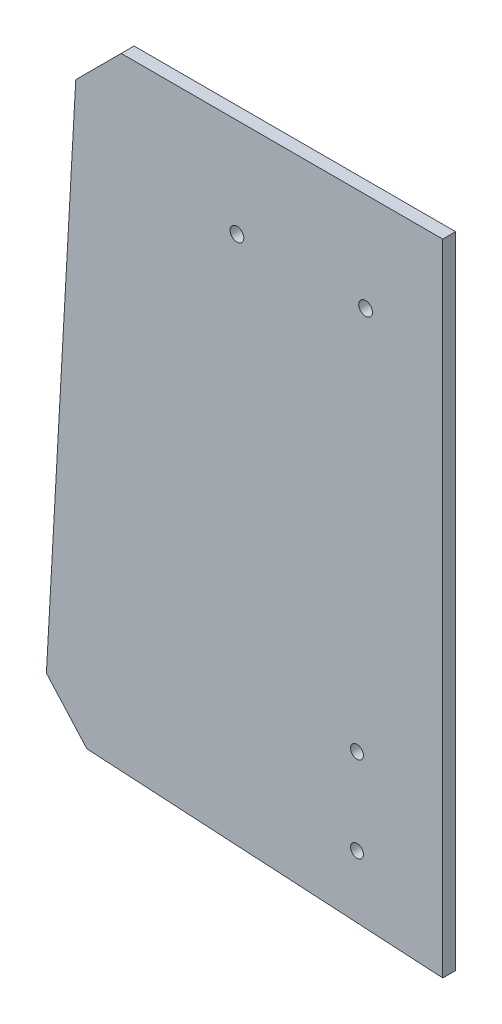
ISO-10303-21;
HEADER;
FILE_DESCRIPTION(('STEP AP214'),'2;1');
FILE_NAME('part.step','',(''),(''),'','','');
FILE_SCHEMA(('AUTOMOTIVE_DESIGN { 1 0 10303 214 1 1 1 1 }'));
ENDSEC;
DATA;
#1=APPLICATION_CONTEXT('core data for automotive mechanical design processes');
#2=APPLICATION_PROTOCOL_DEFINITION('international standard','automotive_design',2000,#1);
#3=PRODUCT_CONTEXT('',#1,'mechanical');
#4=PRODUCT('Part','Part','',(#3));
#5=PRODUCT_RELATED_PRODUCT_CATEGORY('part','',(#4));
#6=PRODUCT_DEFINITION_FORMATION('','',#4);
#7=PRODUCT_DEFINITION_CONTEXT('part definition',#1,'design');
#8=PRODUCT_DEFINITION('design','',#6,#7);
#9=PRODUCT_DEFINITION_SHAPE('','',#8);
#10=(LENGTH_UNIT() NAMED_UNIT(*) SI_UNIT(.MILLI.,.METRE.));
#11=(NAMED_UNIT(*) PLANE_ANGLE_UNIT() SI_UNIT($,.RADIAN.));
#12=(NAMED_UNIT(*) SI_UNIT($,.STERADIAN.) SOLID_ANGLE_UNIT());
#13=UNCERTAINTY_MEASURE_WITH_UNIT(LENGTH_MEASURE(1.E-05),#10,'distance_accuracy_value','');
#14=(GEOMETRIC_REPRESENTATION_CONTEXT(3) GLOBAL_UNCERTAINTY_ASSIGNED_CONTEXT((#13)) GLOBAL_UNIT_ASSIGNED_CONTEXT((#10,
#11,#12)) REPRESENTATION_CONTEXT('',''));
#15=CARTESIAN_POINT('',(0.,0.,0.));
#16=DIRECTION('',(0.,0.,1.));
#17=DIRECTION('',(1.,0.,0.));
#18=AXIS2_PLACEMENT_3D('',#15,#16,#17);
#19=CARTESIAN_POINT('',(0.,33.3553390593262,3.));
#20=DIRECTION('',(0.,1.,0.));
#21=DIRECTION('',(0.,0.,1.));
#22=AXIS2_PLACEMENT_3D('',#19,#20,#21);
#23=PLANE('',#22);
#24=DIRECTION('',(1.,0.,0.));
#25=VECTOR('',#24,1.);
#26=CARTESIAN_POINT('',(0.,33.3553390593262,0.));
#27=LINE('',#26,#25);
#28=CARTESIAN_POINT('',(-71.9999999999999,33.3553390593262,0.));
#29=VERTEX_POINT('',#28);
#30=CARTESIAN_POINT('',(3.00000000000009,33.3553390593262,0.));
#31=VERTEX_POINT('',#30);
#32=EDGE_CURVE('E129',#29,#31,#27,.T.);
#33=ORIENTED_EDGE('',*,*,#32,.F.);
#34=DIRECTION('',(0.,0.,1.));
#35=VECTOR('',#34,1.);
#36=CARTESIAN_POINT('',(-71.9999999999999,33.3553390593262,3.));
#37=LINE('',#36,#35);
#38=CARTESIAN_POINT('',(-71.9999999999999,33.3553390593262,3.));
#39=VERTEX_POINT('',#38);
#40=EDGE_CURVE('E60',#29,#39,#37,.T.);
#41=ORIENTED_EDGE('',*,*,#40,.T.);
#42=DIRECTION('',(1.,0.,0.));
#43=VECTOR('',#42,1.);
#44=CARTESIAN_POINT('',(0.,33.3553390593262,3.));
#45=LINE('',#44,#43);
#46=CARTESIAN_POINT('',(3.00000000000009,33.3553390593262,3.));
#47=VERTEX_POINT('',#46);
#48=EDGE_CURVE('E149',#39,#47,#45,.T.);
#49=ORIENTED_EDGE('',*,*,#48,.T.);
#50=DIRECTION('',(0.,0.,-1.));
#51=VECTOR('',#50,1.);
#52=CARTESIAN_POINT('',(3.00000000000009,33.3553390593262,3.));
#53=LINE('',#52,#51);
#54=EDGE_CURVE('E103',#47,#31,#53,.T.);
#55=ORIENTED_EDGE('',*,*,#54,.T.);
#56=EDGE_LOOP('',(#33,#41,#49,#55));
#57=FACE_BOUND('',#56,.T.);
#58=ADVANCED_FACE('F37',(#57),#23,.T.);
#59=CARTESIAN_POINT('',(-83.596110863182,4.64787317759823,3.));
#60=DIRECTION('',(-0.998457941212826,0.0555134184593621,0.));
#61=DIRECTION('',(-0.0555134184593621,-0.998457941212826,0.));
#62=AXIS2_PLACEMENT_3D('',#59,#60,#61);
#63=PLANE('',#62);
#64=DIRECTION('',(0.0555134184593621,0.998457941212826,0.));
#65=VECTOR('',#64,1.);
#66=CARTESIAN_POINT('',(-83.596110863182,4.64787317759823,3.));
#67=LINE('',#66,#65);
#68=CARTESIAN_POINT('',(-89.4448658154063,-100.547158768256,3.));
#69=VERTEX_POINT('',#68);
#70=CARTESIAN_POINT('',(-82.5887241202404,22.7666149390858,3.));
#71=VERTEX_POINT('',#70);
#72=EDGE_CURVE('E108',#69,#71,#67,.T.);
#73=ORIENTED_EDGE('',*,*,#72,.T.);
#74=DIRECTION('',(0.,0.,-1.));
#75=VECTOR('',#74,1.);
#76=CARTESIAN_POINT('',(-82.5887241202404,22.7666149390858,3.));
#77=LINE('',#76,#75);
#78=CARTESIAN_POINT('',(-82.5887241202404,22.7666149390858,0.));
#79=VERTEX_POINT('',#78);
#80=EDGE_CURVE('E139',#71,#79,#77,.T.);
#81=ORIENTED_EDGE('',*,*,#80,.T.);
#82=DIRECTION('',(0.0555134184593621,0.998457941212826,0.));
#83=VECTOR('',#82,1.);
#84=CARTESIAN_POINT('',(-83.596110863182,4.64787317759823,0.));
#85=LINE('',#84,#83);
#86=CARTESIAN_POINT('',(-89.4448658154063,-100.547158768256,0.));
#87=VERTEX_POINT('',#86);
#88=EDGE_CURVE('E131',#87,#79,#85,.T.);
#89=ORIENTED_EDGE('',*,*,#88,.F.);
#90=DIRECTION('',(0.,0.,1.));
#91=VECTOR('',#90,1.);
#92=CARTESIAN_POINT('',(-89.4448658154063,-100.547158768256,3.));
#93=LINE('',#92,#91);
#94=EDGE_CURVE('E102',#87,#69,#93,.T.);
#95=ORIENTED_EDGE('',*,*,#94,.T.);
#96=EDGE_LOOP('',(#73,#81,#89,#95));
#97=FACE_BOUND('',#96,.T.);
#98=ADVANCED_FACE('F153',(#97),#63,.T.);
#99=CARTESIAN_POINT('',(-6.65290391871126,-115.339295065632,3.));
#100=DIRECTION('',(-0.0575854392452596,-0.998340581759016,0.));
#101=DIRECTION('',(0.998340581759016,-0.0575854392452596,0.));
#102=AXIS2_PLACEMENT_3D('',#99,#100,#101);
#103=PLANE('',#102);
#104=DIRECTION('',(-0.998340581759016,0.0575854392452596,0.));
#105=VECTOR('',#104,1.);
#106=CARTESIAN_POINT('',(-6.65290391871126,-115.339295065632,3.));
#107=LINE('',#106,#105);
#108=CARTESIAN_POINT('',(3.00000000000012,-115.896085726362,3.));
#109=VERTEX_POINT('',#108);
#110=CARTESIAN_POINT('',(-79.9958105372835,-111.108791397522,3.));
#111=VERTEX_POINT('',#110);
#112=EDGE_CURVE('E94',#109,#111,#107,.T.);
#113=ORIENTED_EDGE('',*,*,#112,.T.);
#114=DIRECTION('',(0.,0.,-1.));
#115=VECTOR('',#114,1.);
#116=CARTESIAN_POINT('',(-79.9958105372835,-111.108791397522,3.));
#117=LINE('',#116,#115);
#118=CARTESIAN_POINT('',(-79.9958105372835,-111.108791397522,0.));
#119=VERTEX_POINT('',#118);
#120=EDGE_CURVE('E11',#111,#119,#117,.T.);
#121=ORIENTED_EDGE('',*,*,#120,.T.);
#122=DIRECTION('',(-0.998340581759016,0.0575854392452596,0.));
#123=VECTOR('',#122,1.);
#124=CARTESIAN_POINT('',(-6.65290391871126,-115.339295065632,0.));
#125=LINE('',#124,#123);
#126=CARTESIAN_POINT('',(3.00000000000012,-115.896085726362,0.));
#127=VERTEX_POINT('',#126);
#128=EDGE_CURVE('E97',#127,#119,#125,.T.);
#129=ORIENTED_EDGE('',*,*,#128,.F.);
#130=DIRECTION('',(0.,0.,-1.));
#131=VECTOR('',#130,1.);
#132=CARTESIAN_POINT('',(3.00000000000012,-115.896085726362,3.));
#133=LINE('',#132,#131);
#134=EDGE_CURVE('E92',#109,#127,#133,.T.);
#135=ORIENTED_EDGE('',*,*,#134,.F.);
#136=EDGE_LOOP('',(#113,#121,#129,#135));
#137=FACE_BOUND('',#136,.T.);
#138=ADVANCED_FACE('F93',(#137),#103,.T.);
#139=CARTESIAN_POINT('',(-17.0000000000009,-100.20815280171,3.));
#140=DIRECTION('',(0.,0.,-1.));
#141=DIRECTION('',(-1.,0.,0.));
#142=AXIS2_PLACEMENT_3D('',#139,#140,#141);
#143=CYLINDRICAL_SURFACE('',#142,1.5);
#144=CARTESIAN_POINT('',(-17.0000000000009,-100.20815280171,3.));
#145=DIRECTION('',(0.,0.,1.));
#146=DIRECTION('',(1.,0.,0.));
#147=AXIS2_PLACEMENT_3D('',#144,#145,#146);
#148=CIRCLE('',#147,1.5);
#149=CARTESIAN_POINT('',(-15.5000000000009,-100.20815280171,3.));
#150=VERTEX_POINT('',#149);
#151=EDGE_CURVE('E291',#150,#150,#148,.T.);
#152=ORIENTED_EDGE('',*,*,#151,.T.);
#153=EDGE_LOOP('',(#152));
#154=FACE_BOUND('',#153,.T.);
#155=CARTESIAN_POINT('',(-17.0000000000009,-100.20815280171,0.));
#156=DIRECTION('',(0.,0.,1.));
#157=DIRECTION('',(1.,0.,0.));
#158=AXIS2_PLACEMENT_3D('',#155,#156,#157);
#159=CIRCLE('',#158,1.5);
#160=CARTESIAN_POINT('',(-15.5000000000009,-100.20815280171,0.));
#161=VERTEX_POINT('',#160);
#162=EDGE_CURVE('E126',#161,#161,#159,.T.);
#163=ORIENTED_EDGE('',*,*,#162,.F.);
#164=EDGE_LOOP('',(#163));
#165=FACE_BOUND('',#164,.T.);
#166=ADVANCED_FACE('F172',(#154,#165),#143,.F.);
#167=CARTESIAN_POINT('',(-17.0000000000009,-80.2081528017101,3.));
#168=DIRECTION('',(0.,0.,-1.));
#169=DIRECTION('',(-1.,0.,0.));
#170=AXIS2_PLACEMENT_3D('',#167,#168,#169);
#171=CYLINDRICAL_SURFACE('',#170,1.5);
#172=CARTESIAN_POINT('',(-17.0000000000009,-80.2081528017101,3.));
#173=DIRECTION('',(0.,0.,1.));
#174=DIRECTION('',(1.,0.,0.));
#175=AXIS2_PLACEMENT_3D('',#172,#173,#174);
#176=CIRCLE('',#175,1.5);
#177=CARTESIAN_POINT('',(-15.5000000000009,-80.2081528017101,3.));
#178=VERTEX_POINT('',#177);
#179=EDGE_CURVE('E288',#178,#178,#176,.T.);
#180=ORIENTED_EDGE('',*,*,#179,.T.);
#181=EDGE_LOOP('',(#180));
#182=FACE_BOUND('',#181,.T.);
#183=CARTESIAN_POINT('',(-17.0000000000009,-80.2081528017101,0.));
#184=DIRECTION('',(0.,0.,1.));
#185=DIRECTION('',(1.,0.,0.));
#186=AXIS2_PLACEMENT_3D('',#183,#184,#185);
#187=CIRCLE('',#186,1.5);
#188=CARTESIAN_POINT('',(-15.5000000000009,-80.2081528017101,0.));
#189=VERTEX_POINT('',#188);
#190=EDGE_CURVE('E123',#189,#189,#187,.T.);
#191=ORIENTED_EDGE('',*,*,#190,.F.);
#192=EDGE_LOOP('',(#191));
#193=FACE_BOUND('',#192,.T.);
#194=ADVANCED_FACE('F175',(#182,#193),#171,.F.);
#195=CARTESIAN_POINT('',(-14.9999999999999,10.3553390593263,3.));
#196=DIRECTION('',(0.,0.,-1.));
#197=DIRECTION('',(-1.,0.,0.));
#198=AXIS2_PLACEMENT_3D('',#195,#196,#197);
#199=CYLINDRICAL_SURFACE('',#198,1.60000000000002);
#200=CARTESIAN_POINT('',(-14.9999999999999,10.3553390593263,3.));
#201=DIRECTION('',(0.,0.,1.));
#202=DIRECTION('',(1.,0.,0.));
#203=AXIS2_PLACEMENT_3D('',#200,#201,#202);
#204=CIRCLE('',#203,1.60000000000002);
#205=CARTESIAN_POINT('',(-13.3999999999998,10.3553390593263,3.));
#206=VERTEX_POINT('',#205);
#207=EDGE_CURVE('E284',#206,#206,#204,.T.);
#208=ORIENTED_EDGE('',*,*,#207,.T.);
#209=EDGE_LOOP('',(#208));
#210=FACE_BOUND('',#209,.T.);
#211=CARTESIAN_POINT('',(-14.9999999999999,10.3553390593263,0.));
#212=DIRECTION('',(0.,0.,1.));
#213=DIRECTION('',(1.,0.,0.));
#214=AXIS2_PLACEMENT_3D('',#211,#212,#213);
#215=CIRCLE('',#214,1.60000000000002);
#216=CARTESIAN_POINT('',(-13.3999999999998,10.3553390593263,0.));
#217=VERTEX_POINT('',#216);
#218=EDGE_CURVE('E120',#217,#217,#215,.T.);
#219=ORIENTED_EDGE('',*,*,#218,.F.);
#220=EDGE_LOOP('',(#219));
#221=FACE_BOUND('',#220,.T.);
#222=ADVANCED_FACE('F179',(#210,#221),#199,.F.);
#223=CARTESIAN_POINT('',(-44.9999999999999,10.3553390593262,3.));
#224=DIRECTION('',(0.,0.,-1.));
#225=DIRECTION('',(-1.,0.,0.));
#226=AXIS2_PLACEMENT_3D('',#223,#224,#225);
#227=CYLINDRICAL_SURFACE('',#226,1.60000000000002);
#228=CARTESIAN_POINT('',(-44.9999999999999,10.3553390593262,3.));
#229=DIRECTION('',(0.,0.,1.));
#230=DIRECTION('',(1.,0.,0.));
#231=AXIS2_PLACEMENT_3D('',#228,#229,#230);
#232=CIRCLE('',#231,1.60000000000002);
#233=CARTESIAN_POINT('',(-43.3999999999998,10.3553390593262,3.));
#234=VERTEX_POINT('',#233);
#235=EDGE_CURVE('E136',#234,#234,#232,.T.);
#236=ORIENTED_EDGE('',*,*,#235,.T.);
#237=EDGE_LOOP('',(#236));
#238=FACE_BOUND('',#237,.T.);
#239=CARTESIAN_POINT('',(-44.9999999999999,10.3553390593262,0.));
#240=DIRECTION('',(0.,0.,1.));
#241=DIRECTION('',(1.,0.,0.));
#242=AXIS2_PLACEMENT_3D('',#239,#240,#241);
#243=CIRCLE('',#242,1.60000000000002);
#244=CARTESIAN_POINT('',(-43.3999999999998,10.3553390593262,0.));
#245=VERTEX_POINT('',#244);
#246=EDGE_CURVE('E117',#245,#245,#243,.T.);
#247=ORIENTED_EDGE('',*,*,#246,.F.);
#248=EDGE_LOOP('',(#247));
#249=FACE_BOUND('',#248,.T.);
#250=ADVANCED_FACE('F183',(#238,#249),#227,.F.);
#251=CARTESIAN_POINT('',(3.0000000000001,0.,3.));
#252=DIRECTION('',(1.,0.,0.));
#253=DIRECTION('',(0.,1.,0.));
#254=AXIS2_PLACEMENT_3D('',#251,#252,#253);
#255=PLANE('',#254);
#256=DIRECTION('',(0.,-1.,0.));
#257=VECTOR('',#256,1.);
#258=CARTESIAN_POINT('',(3.0000000000001,0.,0.));
#259=LINE('',#258,#257);
#260=EDGE_CURVE('E135',#31,#127,#259,.T.);
#261=ORIENTED_EDGE('',*,*,#260,.F.);
#262=ORIENTED_EDGE('',*,*,#54,.F.);
#263=DIRECTION('',(0.,-1.,0.));
#264=VECTOR('',#263,1.);
#265=CARTESIAN_POINT('',(3.0000000000001,0.,3.));
#266=LINE('',#265,#264);
#267=EDGE_CURVE('E107',#47,#109,#266,.T.);
#268=ORIENTED_EDGE('',*,*,#267,.T.);
#269=ORIENTED_EDGE('',*,*,#134,.T.);
#270=EDGE_LOOP('',(#261,#262,#268,#269));
#271=FACE_BOUND('',#270,.T.);
#272=ADVANCED_FACE('F111',(#271),#255,.T.);
#273=CARTESIAN_POINT('',(0.,0.,3.));
#274=DIRECTION('',(0.,0.,1.));
#275=DIRECTION('',(1.,0.,0.));
#276=AXIS2_PLACEMENT_3D('',#273,#274,#275);
#277=PLANE('',#276);
#278=ORIENTED_EDGE('',*,*,#235,.F.);
#279=EDGE_LOOP('',(#278));
#280=FACE_BOUND('',#279,.T.);
#281=ORIENTED_EDGE('',*,*,#207,.F.);
#282=EDGE_LOOP('',(#281));
#283=FACE_BOUND('',#282,.T.);
#284=ORIENTED_EDGE('',*,*,#179,.F.);
#285=EDGE_LOOP('',(#284));
#286=FACE_BOUND('',#285,.T.);
#287=ORIENTED_EDGE('',*,*,#151,.F.);
#288=EDGE_LOOP('',(#287));
#289=FACE_BOUND('',#288,.T.);
#290=ORIENTED_EDGE('',*,*,#48,.F.);
#291=DIRECTION('',(0.707106781186549,0.707106781186546,0.));
#292=VECTOR('',#291,1.);
#293=CARTESIAN_POINT('',(-52.6776695296629,52.6776695296631,3.));
#294=LINE('',#293,#292);
#295=EDGE_CURVE('E45',#39,#71,#294,.F.);
#296=ORIENTED_EDGE('',*,*,#295,.T.);
#297=ORIENTED_EDGE('',*,*,#72,.F.);
#298=DIRECTION('',(-0.666762466321688,0.74527029560061,0.));
#299=VECTOR('',#298,1.);
#300=CARTESIAN_POINT('',(-99.6438854694294,-89.1472573396069,3.));
#301=LINE('',#300,#299);
#302=EDGE_CURVE('E52',#69,#111,#301,.F.);
#303=ORIENTED_EDGE('',*,*,#302,.T.);
#304=ORIENTED_EDGE('',*,*,#112,.F.);
#305=ORIENTED_EDGE('',*,*,#267,.F.);
#306=EDGE_LOOP('',(#290,#296,#297,#303,#304,#305));
#307=FACE_BOUND('',#306,.T.);
#308=ADVANCED_FACE('F106',(#280,#283,#286,#289,#307),#277,.T.);
#309=CARTESIAN_POINT('',(0.,0.,0.));
#310=DIRECTION('',(0.,0.,1.));
#311=DIRECTION('',(1.,0.,0.));
#312=AXIS2_PLACEMENT_3D('',#309,#310,#311);
#313=PLANE('',#312);
#314=ORIENTED_EDGE('',*,*,#246,.T.);
#315=EDGE_LOOP('',(#314));
#316=FACE_BOUND('',#315,.T.);
#317=ORIENTED_EDGE('',*,*,#218,.T.);
#318=EDGE_LOOP('',(#317));
#319=FACE_BOUND('',#318,.T.);
#320=ORIENTED_EDGE('',*,*,#190,.T.);
#321=EDGE_LOOP('',(#320));
#322=FACE_BOUND('',#321,.T.);
#323=ORIENTED_EDGE('',*,*,#162,.T.);
#324=EDGE_LOOP('',(#323));
#325=FACE_BOUND('',#324,.T.);
#326=ORIENTED_EDGE('',*,*,#88,.T.);
#327=DIRECTION('',(-0.707106781186549,-0.707106781186546,0.));
#328=VECTOR('',#327,1.);
#329=CARTESIAN_POINT('',(-82.5887241202404,22.7666149390858,0.));
#330=LINE('',#329,#328);
#331=EDGE_CURVE('E144',#79,#29,#330,.F.);
#332=ORIENTED_EDGE('',*,*,#331,.T.);
#333=ORIENTED_EDGE('',*,*,#32,.T.);
#334=ORIENTED_EDGE('',*,*,#260,.T.);
#335=ORIENTED_EDGE('',*,*,#128,.T.);
#336=DIRECTION('',(0.666762466321688,-0.74527029560061,0.));
#337=VECTOR('',#336,1.);
#338=CARTESIAN_POINT('',(-79.9958105372835,-111.108791397522,0.));
#339=LINE('',#338,#337);
#340=EDGE_CURVE('E142',#119,#87,#339,.F.);
#341=ORIENTED_EDGE('',*,*,#340,.T.);
#342=EDGE_LOOP('',(#326,#332,#333,#334,#335,#341));
#343=FACE_BOUND('',#342,.T.);
#344=ADVANCED_FACE('F158',(#316,#319,#322,#325,#343),#313,.F.);
#345=CARTESIAN_POINT('',(-82.5887241202404,22.7666149390858,3.));
#346=DIRECTION('',(0.707106781186546,-0.707106781186549,0.));
#347=DIRECTION('',(0.,0.,-1.));
#348=AXIS2_PLACEMENT_3D('',#345,#346,#347);
#349=PLANE('',#348);
#350=ORIENTED_EDGE('',*,*,#295,.F.);
#351=ORIENTED_EDGE('',*,*,#40,.F.);
#352=ORIENTED_EDGE('',*,*,#331,.F.);
#353=ORIENTED_EDGE('',*,*,#80,.F.);
#354=EDGE_LOOP('',(#350,#351,#352,#353));
#355=FACE_BOUND('',#354,.T.);
#356=ADVANCED_FACE('F156',(#355),#349,.F.);
#357=CARTESIAN_POINT('',(-79.9958105372835,-111.108791397522,3.));
#358=DIRECTION('',(0.74527029560061,0.666762466321687,0.));
#359=DIRECTION('',(0.,0.,-1.));
#360=AXIS2_PLACEMENT_3D('',#357,#358,#359);
#361=PLANE('',#360);
#362=ORIENTED_EDGE('',*,*,#302,.F.);
#363=ORIENTED_EDGE('',*,*,#94,.F.);
#364=ORIENTED_EDGE('',*,*,#340,.F.);
#365=ORIENTED_EDGE('',*,*,#120,.F.);
#366=EDGE_LOOP('',(#362,#363,#364,#365));
#367=FACE_BOUND('',#366,.T.);
#368=ADVANCED_FACE('F39',(#367),#361,.F.);
#369=CLOSED_SHELL('',(#58,#98,#138,#166,#194,#222,#250,#272,#308,#344,#356,#368));
#370=MANIFOLD_SOLID_BREP('B2',#369);
#371=ADVANCED_BREP_SHAPE_REPRESENTATION('',(#18,#370),#14);
#372=SHAPE_DEFINITION_REPRESENTATION(#9,#371);
ENDSEC;
END-ISO-10303-21;
